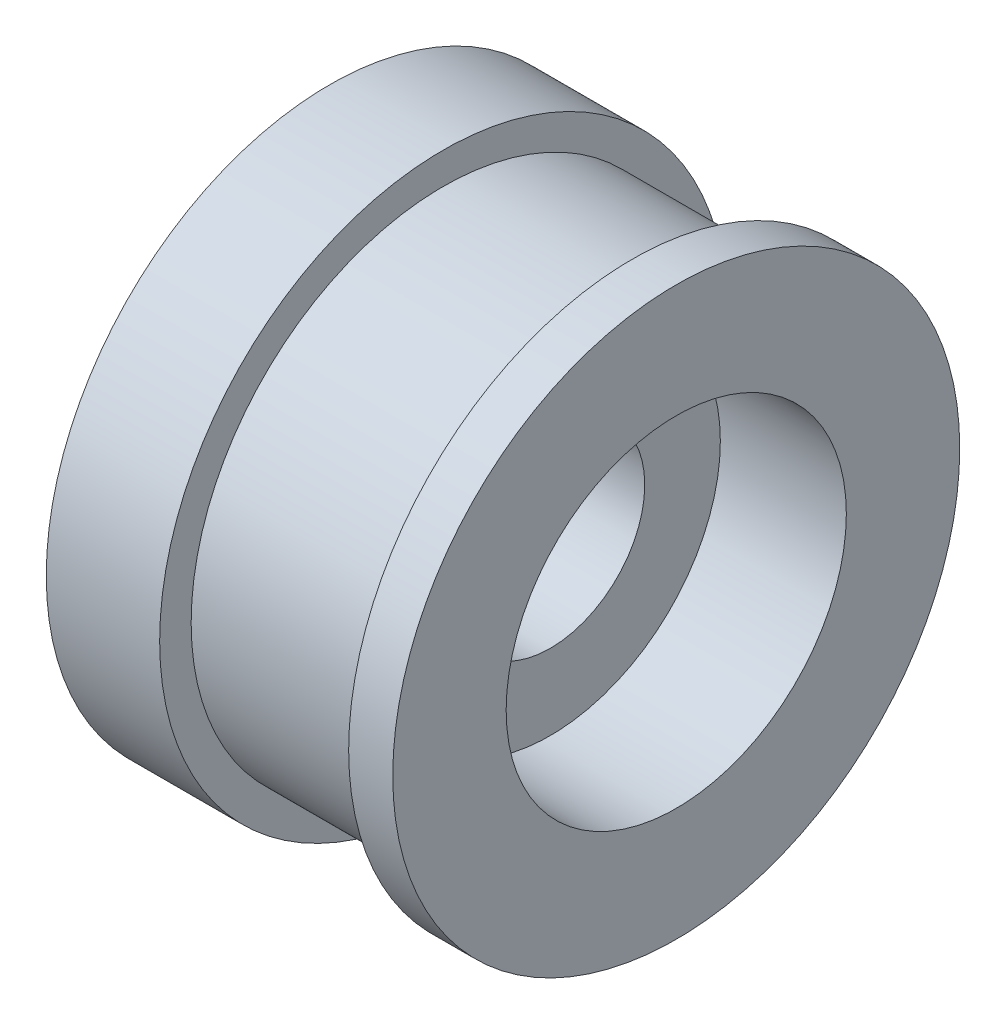
ISO-10303-21;
HEADER;
FILE_DESCRIPTION(('STEP AP214'),'2;1');
FILE_NAME('part.step','',(''),(''),'','','');
FILE_SCHEMA(('AUTOMOTIVE_DESIGN { 1 0 10303 214 1 1 1 1 }'));
ENDSEC;
DATA;
#1=APPLICATION_CONTEXT('core data for automotive mechanical design processes');
#2=APPLICATION_PROTOCOL_DEFINITION('international standard','automotive_design',2000,#1);
#3=PRODUCT_CONTEXT('',#1,'mechanical');
#4=PRODUCT('Part','Part','',(#3));
#5=PRODUCT_RELATED_PRODUCT_CATEGORY('part','',(#4));
#6=PRODUCT_DEFINITION_FORMATION('','',#4);
#7=PRODUCT_DEFINITION_CONTEXT('part definition',#1,'design');
#8=PRODUCT_DEFINITION('design','',#6,#7);
#9=PRODUCT_DEFINITION_SHAPE('','',#8);
#10=(LENGTH_UNIT() NAMED_UNIT(*) SI_UNIT(.MILLI.,.METRE.));
#11=(NAMED_UNIT(*) PLANE_ANGLE_UNIT() SI_UNIT($,.RADIAN.));
#12=(NAMED_UNIT(*) SI_UNIT($,.STERADIAN.) SOLID_ANGLE_UNIT());
#13=UNCERTAINTY_MEASURE_WITH_UNIT(LENGTH_MEASURE(1.E-05),#10,'distance_accuracy_value','');
#14=(GEOMETRIC_REPRESENTATION_CONTEXT(3) GLOBAL_UNCERTAINTY_ASSIGNED_CONTEXT((#13)) GLOBAL_UNIT_ASSIGNED_CONTEXT((#10,
#11,#12)) REPRESENTATION_CONTEXT('',''));
#15=CARTESIAN_POINT('',(0.,0.,0.));
#16=DIRECTION('',(0.,0.,1.));
#17=DIRECTION('',(1.,0.,0.));
#18=AXIS2_PLACEMENT_3D('',#15,#16,#17);
#19=CARTESIAN_POINT('',(10.,0.,0.));
#20=DIRECTION('',(-1.,0.,0.));
#21=DIRECTION('',(0.,0.,1.));
#22=AXIS2_PLACEMENT_3D('',#19,#20,#21);
#23=CYLINDRICAL_SURFACE('',#22,1.5);
#24=CARTESIAN_POINT('',(0.,0.,0.));
#25=DIRECTION('',(-1.,0.,0.));
#26=DIRECTION('',(0.,0.,1.));
#27=AXIS2_PLACEMENT_3D('',#24,#25,#26);
#28=CIRCLE('',#27,1.5);
#29=CARTESIAN_POINT('',(0.,0.,1.5));
#30=VERTEX_POINT('',#29);
#31=EDGE_CURVE('E58',#30,#30,#28,.T.);
#32=ORIENTED_EDGE('',*,*,#31,.T.);
#33=EDGE_LOOP('',(#32));
#34=FACE_BOUND('',#33,.T.);
#35=CARTESIAN_POINT('',(3.5,0.,0.));
#36=DIRECTION('',(1.,0.,0.));
#37=DIRECTION('',(0.,0.,-1.));
#38=AXIS2_PLACEMENT_3D('',#35,#36,#37);
#39=CIRCLE('',#38,1.5);
#40=CARTESIAN_POINT('',(3.5,0.,-1.5));
#41=VERTEX_POINT('',#40);
#42=EDGE_CURVE('E36',#41,#41,#39,.F.);
#43=ORIENTED_EDGE('',*,*,#42,.F.);
#44=EDGE_LOOP('',(#43));
#45=FACE_BOUND('',#44,.T.);
#46=ADVANCED_FACE('F32',(#34,#45),#23,.F.);
#47=CARTESIAN_POINT('',(5.5,0.,0.));
#48=DIRECTION('',(-1.,0.,0.));
#49=DIRECTION('',(0.,0.,1.));
#50=AXIS2_PLACEMENT_3D('',#47,#48,#49);
#51=PLANE('',#50);
#52=CARTESIAN_POINT('',(5.5,0.,0.));
#53=DIRECTION('',(1.,0.,0.));
#54=DIRECTION('',(0.,0.,-1.));
#55=AXIS2_PLACEMENT_3D('',#52,#53,#54);
#56=CIRCLE('',#55,2.7);
#57=CARTESIAN_POINT('',(5.5,0.,-2.7));
#58=VERTEX_POINT('',#57);
#59=EDGE_CURVE('E61',#58,#58,#56,.T.);
#60=ORIENTED_EDGE('',*,*,#59,.F.);
#61=EDGE_LOOP('',(#60));
#62=FACE_BOUND('',#61,.T.);
#63=CARTESIAN_POINT('',(5.50000000000001,0.,0.));
#64=DIRECTION('',(-1.,0.,0.));
#65=DIRECTION('',(0.,0.,1.));
#66=AXIS2_PLACEMENT_3D('',#63,#64,#65);
#67=CIRCLE('',#66,4.5);
#68=CARTESIAN_POINT('',(5.50000000000001,0.,4.5));
#69=VERTEX_POINT('',#68);
#70=EDGE_CURVE('E10',#69,#69,#67,.T.);
#71=ORIENTED_EDGE('',*,*,#70,.F.);
#72=EDGE_LOOP('',(#71));
#73=FACE_BOUND('',#72,.T.);
#74=ADVANCED_FACE('F34',(#62,#73),#51,.F.);
#75=CARTESIAN_POINT('',(-92.3357649099317,0.,0.));
#76=DIRECTION('',(-1.,0.,0.));
#77=DIRECTION('',(0.,0.,1.));
#78=AXIS2_PLACEMENT_3D('',#75,#76,#77);
#79=CYLINDRICAL_SURFACE('',#78,4.5);
#80=CARTESIAN_POINT('',(4.8,0.,0.));
#81=DIRECTION('',(-1.,0.,0.));
#82=DIRECTION('',(0.,0.,1.));
#83=AXIS2_PLACEMENT_3D('',#80,#81,#82);
#84=CIRCLE('',#83,4.5);
#85=CARTESIAN_POINT('',(4.8,0.,4.5));
#86=VERTEX_POINT('',#85);
#87=EDGE_CURVE('E40',#86,#86,#84,.T.);
#88=ORIENTED_EDGE('',*,*,#87,.F.);
#89=EDGE_LOOP('',(#88));
#90=FACE_BOUND('',#89,.T.);
#91=ORIENTED_EDGE('',*,*,#70,.T.);
#92=EDGE_LOOP('',(#91));
#93=FACE_BOUND('',#92,.T.);
#94=ADVANCED_FACE('F79',(#90,#93),#79,.T.);
#95=CARTESIAN_POINT('',(4.8,0.,-4.5));
#96=DIRECTION('',(1.,0.,0.));
#97=DIRECTION('',(0.,0.,-1.));
#98=AXIS2_PLACEMENT_3D('',#95,#96,#97);
#99=PLANE('',#98);
#100=CARTESIAN_POINT('',(4.8,0.,0.));
#101=DIRECTION('',(-1.,0.,0.));
#102=DIRECTION('',(0.,0.,1.));
#103=AXIS2_PLACEMENT_3D('',#100,#101,#102);
#104=CIRCLE('',#103,4.);
#105=CARTESIAN_POINT('',(4.8,0.,4.));
#106=VERTEX_POINT('',#105);
#107=EDGE_CURVE('E44',#106,#106,#104,.T.);
#108=ORIENTED_EDGE('',*,*,#107,.F.);
#109=EDGE_LOOP('',(#108));
#110=FACE_BOUND('',#109,.T.);
#111=ORIENTED_EDGE('',*,*,#87,.T.);
#112=EDGE_LOOP('',(#111));
#113=FACE_BOUND('',#112,.T.);
#114=ADVANCED_FACE('F100',(#110,#113),#99,.F.);
#115=CARTESIAN_POINT('',(-92.3357649099317,0.,0.));
#116=DIRECTION('',(-1.,0.,0.));
#117=DIRECTION('',(0.,0.,1.));
#118=AXIS2_PLACEMENT_3D('',#115,#116,#117);
#119=CYLINDRICAL_SURFACE('',#118,4.);
#120=CARTESIAN_POINT('',(1.8,0.,0.));
#121=DIRECTION('',(-1.,0.,0.));
#122=DIRECTION('',(0.,0.,1.));
#123=AXIS2_PLACEMENT_3D('',#120,#121,#122);
#124=CIRCLE('',#123,4.);
#125=CARTESIAN_POINT('',(1.8,0.,4.));
#126=VERTEX_POINT('',#125);
#127=EDGE_CURVE('E49',#126,#126,#124,.T.);
#128=ORIENTED_EDGE('',*,*,#127,.F.);
#129=EDGE_LOOP('',(#128));
#130=FACE_BOUND('',#129,.T.);
#131=ORIENTED_EDGE('',*,*,#107,.T.);
#132=EDGE_LOOP('',(#131));
#133=FACE_BOUND('',#132,.T.);
#134=ADVANCED_FACE('F96',(#130,#133),#119,.T.);
#135=CARTESIAN_POINT('',(1.8,0.,-4.));
#136=DIRECTION('',(-1.,0.,0.));
#137=DIRECTION('',(0.,0.,1.));
#138=AXIS2_PLACEMENT_3D('',#135,#136,#137);
#139=PLANE('',#138);
#140=CARTESIAN_POINT('',(1.8,0.,0.));
#141=DIRECTION('',(-1.,0.,0.));
#142=DIRECTION('',(0.,0.,1.));
#143=AXIS2_PLACEMENT_3D('',#140,#141,#142);
#144=CIRCLE('',#143,4.5);
#145=CARTESIAN_POINT('',(1.8,0.,4.5));
#146=VERTEX_POINT('',#145);
#147=EDGE_CURVE('E52',#146,#146,#144,.T.);
#148=ORIENTED_EDGE('',*,*,#147,.F.);
#149=EDGE_LOOP('',(#148));
#150=FACE_BOUND('',#149,.T.);
#151=ORIENTED_EDGE('',*,*,#127,.T.);
#152=EDGE_LOOP('',(#151));
#153=FACE_BOUND('',#152,.T.);
#154=ADVANCED_FACE('F92',(#150,#153),#139,.F.);
#155=CARTESIAN_POINT('',(-92.3357649099317,0.,0.));
#156=DIRECTION('',(-1.,0.,0.));
#157=DIRECTION('',(0.,0.,1.));
#158=AXIS2_PLACEMENT_3D('',#155,#156,#157);
#159=CYLINDRICAL_SURFACE('',#158,4.5);
#160=CARTESIAN_POINT('',(0.,0.,0.));
#161=DIRECTION('',(-1.,0.,0.));
#162=DIRECTION('',(0.,0.,1.));
#163=AXIS2_PLACEMENT_3D('',#160,#161,#162);
#164=CIRCLE('',#163,4.5);
#165=CARTESIAN_POINT('',(0.,0.,4.5));
#166=VERTEX_POINT('',#165);
#167=EDGE_CURVE('E55',#166,#166,#164,.T.);
#168=ORIENTED_EDGE('',*,*,#167,.F.);
#169=EDGE_LOOP('',(#168));
#170=FACE_BOUND('',#169,.T.);
#171=ORIENTED_EDGE('',*,*,#147,.T.);
#172=EDGE_LOOP('',(#171));
#173=FACE_BOUND('',#172,.T.);
#174=ADVANCED_FACE('F88',(#170,#173),#159,.T.);
#175=CARTESIAN_POINT('',(0.,0.,0.));
#176=DIRECTION('',(1.,0.,0.));
#177=DIRECTION('',(0.,0.,-1.));
#178=AXIS2_PLACEMENT_3D('',#175,#176,#177);
#179=PLANE('',#178);
#180=ORIENTED_EDGE('',*,*,#31,.F.);
#181=EDGE_LOOP('',(#180));
#182=FACE_BOUND('',#181,.T.);
#183=ORIENTED_EDGE('',*,*,#167,.T.);
#184=EDGE_LOOP('',(#183));
#185=FACE_BOUND('',#184,.T.);
#186=ADVANCED_FACE('F85',(#182,#185),#179,.F.);
#187=CARTESIAN_POINT('',(3.5,0.,0.));
#188=DIRECTION('',(1.,0.,0.));
#189=DIRECTION('',(0.,0.,-1.));
#190=AXIS2_PLACEMENT_3D('',#187,#188,#189);
#191=PLANE('',#190);
#192=CARTESIAN_POINT('',(3.5,0.,0.));
#193=DIRECTION('',(1.,0.,0.));
#194=DIRECTION('',(0.,0.,-1.));
#195=AXIS2_PLACEMENT_3D('',#192,#193,#194);
#196=CIRCLE('',#195,2.7);
#197=CARTESIAN_POINT('',(3.5,0.,-2.7));
#198=VERTEX_POINT('',#197);
#199=EDGE_CURVE('E64',#198,#198,#196,.T.);
#200=ORIENTED_EDGE('',*,*,#199,.T.);
#201=EDGE_LOOP('',(#200));
#202=FACE_BOUND('',#201,.T.);
#203=ORIENTED_EDGE('',*,*,#42,.T.);
#204=EDGE_LOOP('',(#203));
#205=FACE_BOUND('',#204,.T.);
#206=ADVANCED_FACE('F71',(#202,#205),#191,.T.);
#207=CARTESIAN_POINT('',(3.5,0.,0.));
#208=DIRECTION('',(1.,0.,0.));
#209=DIRECTION('',(0.,0.,-1.));
#210=AXIS2_PLACEMENT_3D('',#207,#208,#209);
#211=CYLINDRICAL_SURFACE('',#210,2.7);
#212=ORIENTED_EDGE('',*,*,#199,.F.);
#213=EDGE_LOOP('',(#212));
#214=FACE_BOUND('',#213,.T.);
#215=ORIENTED_EDGE('',*,*,#59,.T.);
#216=EDGE_LOOP('',(#215));
#217=FACE_BOUND('',#216,.T.);
#218=ADVANCED_FACE('F83',(#214,#217),#211,.F.);
#219=CLOSED_SHELL('',(#46,#74,#94,#114,#134,#154,#174,#186,#206,#218));
#220=MANIFOLD_SOLID_BREP('B2',#219);
#221=ADVANCED_BREP_SHAPE_REPRESENTATION('',(#18,#220),#14);
#222=SHAPE_DEFINITION_REPRESENTATION(#9,#221);
ENDSEC;
END-ISO-10303-21;
